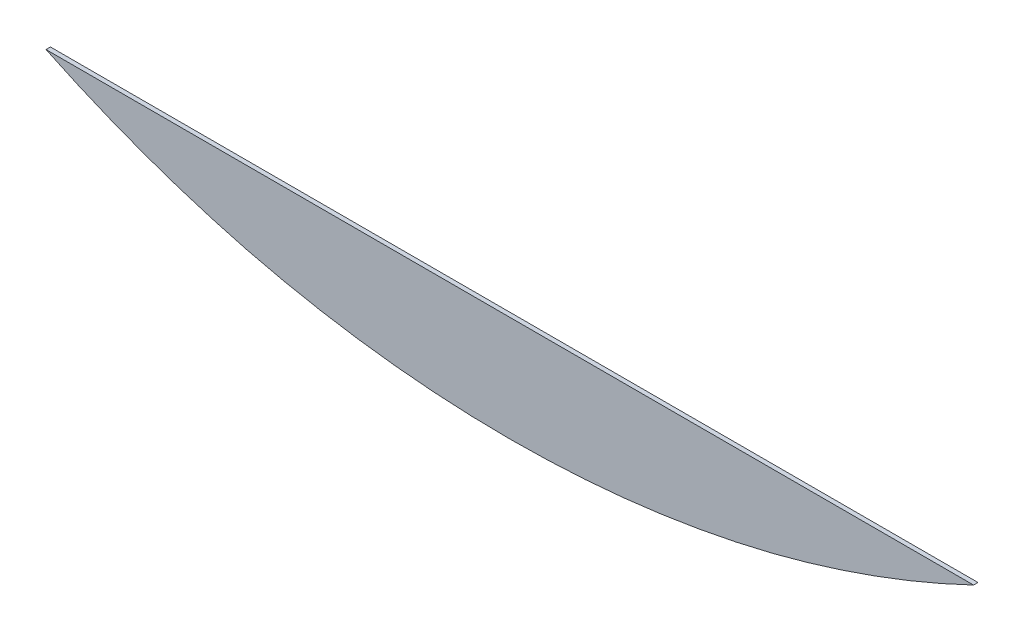
ISO-10303-21;
HEADER;
FILE_DESCRIPTION(('STEP AP214'),'2;1');
FILE_NAME('part.step','',(''),(''),'','','');
FILE_SCHEMA(('AUTOMOTIVE_DESIGN { 1 0 10303 214 1 1 1 1 }'));
ENDSEC;
DATA;
#1=APPLICATION_CONTEXT('core data for automotive mechanical design processes');
#2=APPLICATION_PROTOCOL_DEFINITION('international standard','automotive_design',2000,#1);
#3=PRODUCT_CONTEXT('',#1,'mechanical');
#4=PRODUCT('Part','Part','',(#3));
#5=PRODUCT_RELATED_PRODUCT_CATEGORY('part','',(#4));
#6=PRODUCT_DEFINITION_FORMATION('','',#4);
#7=PRODUCT_DEFINITION_CONTEXT('part definition',#1,'design');
#8=PRODUCT_DEFINITION('design','',#6,#7);
#9=PRODUCT_DEFINITION_SHAPE('','',#8);
#10=(LENGTH_UNIT() NAMED_UNIT(*) SI_UNIT(.MILLI.,.METRE.));
#11=(NAMED_UNIT(*) PLANE_ANGLE_UNIT() SI_UNIT($,.RADIAN.));
#12=(NAMED_UNIT(*) SI_UNIT($,.STERADIAN.) SOLID_ANGLE_UNIT());
#13=UNCERTAINTY_MEASURE_WITH_UNIT(LENGTH_MEASURE(1.E-05),#10,'distance_accuracy_value','');
#14=(GEOMETRIC_REPRESENTATION_CONTEXT(3) GLOBAL_UNCERTAINTY_ASSIGNED_CONTEXT((#13)) GLOBAL_UNIT_ASSIGNED_CONTEXT((#10,
#11,#12)) REPRESENTATION_CONTEXT('',''));
#15=CARTESIAN_POINT('',(0.,0.,0.));
#16=DIRECTION('',(0.,0.,1.));
#17=DIRECTION('',(1.,0.,0.));
#18=AXIS2_PLACEMENT_3D('',#15,#16,#17);
#19=CARTESIAN_POINT('',(338.952079060061,706.205902691886,3.2004));
#20=DIRECTION('',(0.,0.,-1.));
#21=DIRECTION('',(-1.,0.,0.));
#22=AXIS2_PLACEMENT_3D('',#19,#20,#21);
#23=CYLINDRICAL_SURFACE('',#22,783.336);
#24=CARTESIAN_POINT('',(338.952079060061,706.205902691886,0.));
#25=DIRECTION('',(0.,0.,1.));
#26=DIRECTION('',(1.,0.,0.));
#27=AXIS2_PLACEMENT_3D('',#24,#25,#26);
#28=CIRCLE('',#27,783.336);
#29=CARTESIAN_POINT('',(0.,0.,0.));
#30=VERTEX_POINT('',#29);
#31=CARTESIAN_POINT('',(144.78,-52.6830830033161,0.));
#32=VERTEX_POINT('',#31);
#33=EDGE_CURVE('E96',#30,#32,#28,.T.);
#34=ORIENTED_EDGE('',*,*,#33,.T.);
#35=DIRECTION('',(0.,0.,-1.));
#36=VECTOR('',#35,1.);
#37=CARTESIAN_POINT('',(144.78,-52.6830830033161,3.2004));
#38=LINE('',#37,#36);
#39=CARTESIAN_POINT('',(144.78,-52.6830830033161,3.2004));
#40=VERTEX_POINT('',#39);
#41=EDGE_CURVE('E11',#40,#32,#38,.T.);
#42=ORIENTED_EDGE('',*,*,#41,.F.);
#43=CARTESIAN_POINT('',(338.952079060061,706.205902691886,3.2004));
#44=DIRECTION('',(0.,0.,1.));
#45=DIRECTION('',(1.,0.,0.));
#46=AXIS2_PLACEMENT_3D('',#43,#44,#45);
#47=CIRCLE('',#46,783.336);
#48=CARTESIAN_POINT('',(0.,0.,3.2004));
#49=VERTEX_POINT('',#48);
#50=EDGE_CURVE('E84',#49,#40,#47,.T.);
#51=ORIENTED_EDGE('',*,*,#50,.F.);
#52=DIRECTION('',(0.,0.,-1.));
#53=VECTOR('',#52,1.);
#54=CARTESIAN_POINT('',(0.,0.,3.2004));
#55=LINE('',#54,#53);
#56=EDGE_CURVE('E92',#49,#30,#55,.T.);
#57=ORIENTED_EDGE('',*,*,#56,.T.);
#58=EDGE_LOOP('',(#34,#42,#51,#57));
#59=FACE_BOUND('',#58,.T.);
#60=ADVANCED_FACE('F33',(#59),#23,.T.);
#61=CARTESIAN_POINT('',(335.28,707.136,3.2004));
#62=DIRECTION('',(0.,0.,-1.));
#63=DIRECTION('',(-1.,0.,0.));
#64=AXIS2_PLACEMENT_3D('',#61,#62,#63);
#65=CYLINDRICAL_SURFACE('',#64,783.336);
#66=CARTESIAN_POINT('',(335.28,707.136,0.));
#67=DIRECTION('',(0.,0.,1.));
#68=DIRECTION('',(1.,0.,0.));
#69=AXIS2_PLACEMENT_3D('',#66,#67,#68);
#70=CIRCLE('',#69,783.336);
#71=CARTESIAN_POINT('',(525.78,-52.6830830033161,0.));
#72=VERTEX_POINT('',#71);
#73=EDGE_CURVE('E88',#32,#72,#70,.T.);
#74=ORIENTED_EDGE('',*,*,#73,.T.);
#75=DIRECTION('',(0.,0.,-1.));
#76=VECTOR('',#75,1.);
#77=CARTESIAN_POINT('',(525.78,-52.6830830033161,3.2004));
#78=LINE('',#77,#76);
#79=CARTESIAN_POINT('',(525.78,-52.6830830033161,3.2004));
#80=VERTEX_POINT('',#79);
#81=EDGE_CURVE('E41',#80,#72,#78,.T.);
#82=ORIENTED_EDGE('',*,*,#81,.F.);
#83=CARTESIAN_POINT('',(335.28,707.136,3.2004));
#84=DIRECTION('',(0.,0.,1.));
#85=DIRECTION('',(1.,0.,0.));
#86=AXIS2_PLACEMENT_3D('',#83,#84,#85);
#87=CIRCLE('',#86,783.336);
#88=EDGE_CURVE('E79',#40,#80,#87,.T.);
#89=ORIENTED_EDGE('',*,*,#88,.F.);
#90=ORIENTED_EDGE('',*,*,#41,.T.);
#91=EDGE_LOOP('',(#74,#82,#89,#90));
#92=FACE_BOUND('',#91,.T.);
#93=ADVANCED_FACE('F87',(#92),#65,.T.);
#94=CARTESIAN_POINT('',(331.607920939939,706.205902691887,3.2004));
#95=DIRECTION('',(0.,0.,-1.));
#96=DIRECTION('',(-1.,0.,0.));
#97=AXIS2_PLACEMENT_3D('',#94,#95,#96);
#98=CYLINDRICAL_SURFACE('',#97,783.336);
#99=CARTESIAN_POINT('',(331.607920939939,706.205902691887,0.));
#100=DIRECTION('',(0.,0.,1.));
#101=DIRECTION('',(-1.,0.,0.));
#102=AXIS2_PLACEMENT_3D('',#99,#100,#101);
#103=CIRCLE('',#102,783.336);
#104=CARTESIAN_POINT('',(670.56,0.,0.));
#105=VERTEX_POINT('',#104);
#106=EDGE_CURVE('E66',#72,#105,#103,.T.);
#107=ORIENTED_EDGE('',*,*,#106,.T.);
#108=DIRECTION('',(0.,0.,-1.));
#109=VECTOR('',#108,1.);
#110=CARTESIAN_POINT('',(670.56,0.,3.2004));
#111=LINE('',#110,#109);
#112=CARTESIAN_POINT('',(670.56,0.,3.2004));
#113=VERTEX_POINT('',#112);
#114=EDGE_CURVE('E89',#113,#105,#111,.T.);
#115=ORIENTED_EDGE('',*,*,#114,.F.);
#116=CARTESIAN_POINT('',(331.607920939939,706.205902691887,3.2004));
#117=DIRECTION('',(0.,0.,1.));
#118=DIRECTION('',(-1.,0.,0.));
#119=AXIS2_PLACEMENT_3D('',#116,#117,#118);
#120=CIRCLE('',#119,783.336);
#121=EDGE_CURVE('E82',#80,#113,#120,.T.);
#122=ORIENTED_EDGE('',*,*,#121,.F.);
#123=ORIENTED_EDGE('',*,*,#81,.T.);
#124=EDGE_LOOP('',(#107,#115,#122,#123));
#125=FACE_BOUND('',#124,.T.);
#126=ADVANCED_FACE('F90',(#125),#98,.T.);
#127=CARTESIAN_POINT('',(0.,0.,3.2004));
#128=DIRECTION('',(0.,-1.,0.));
#129=DIRECTION('',(1.,0.,0.));
#130=AXIS2_PLACEMENT_3D('',#127,#128,#129);
#131=PLANE('',#130);
#132=DIRECTION('',(-1.,0.,0.));
#133=VECTOR('',#132,1.);
#134=CARTESIAN_POINT('',(0.,0.,0.));
#135=LINE('',#134,#133);
#136=EDGE_CURVE('E72',#105,#30,#135,.T.);
#137=ORIENTED_EDGE('',*,*,#136,.T.);
#138=ORIENTED_EDGE('',*,*,#56,.F.);
#139=DIRECTION('',(-1.,0.,0.));
#140=VECTOR('',#139,1.);
#141=CARTESIAN_POINT('',(0.,0.,3.2004));
#142=LINE('',#141,#140);
#143=EDGE_CURVE('E49',#113,#49,#142,.T.);
#144=ORIENTED_EDGE('',*,*,#143,.F.);
#145=ORIENTED_EDGE('',*,*,#114,.T.);
#146=EDGE_LOOP('',(#137,#138,#144,#145));
#147=FACE_BOUND('',#146,.T.);
#148=ADVANCED_FACE('F103',(#147),#131,.F.);
#149=CARTESIAN_POINT('',(338.952079060061,706.205902691886,3.2004));
#150=DIRECTION('',(0.,0.,1.));
#151=DIRECTION('',(1.,0.,0.));
#152=AXIS2_PLACEMENT_3D('',#149,#150,#151);
#153=PLANE('',#152);
#154=ORIENTED_EDGE('',*,*,#50,.T.);
#155=ORIENTED_EDGE('',*,*,#88,.T.);
#156=ORIENTED_EDGE('',*,*,#121,.T.);
#157=ORIENTED_EDGE('',*,*,#143,.T.);
#158=EDGE_LOOP('',(#154,#155,#156,#157));
#159=FACE_BOUND('',#158,.T.);
#160=ADVANCED_FACE('F80',(#159),#153,.T.);
#161=CARTESIAN_POINT('',(338.952079060061,706.205902691886,0.));
#162=DIRECTION('',(0.,0.,1.));
#163=DIRECTION('',(1.,0.,0.));
#164=AXIS2_PLACEMENT_3D('',#161,#162,#163);
#165=PLANE('',#164);
#166=ORIENTED_EDGE('',*,*,#33,.F.);
#167=ORIENTED_EDGE('',*,*,#136,.F.);
#168=ORIENTED_EDGE('',*,*,#106,.F.);
#169=ORIENTED_EDGE('',*,*,#73,.F.);
#170=EDGE_LOOP('',(#166,#167,#168,#169));
#171=FACE_BOUND('',#170,.T.);
#172=ADVANCED_FACE('F106',(#171),#165,.F.);
#173=CLOSED_SHELL('',(#60,#93,#126,#148,#160,#172));
#174=MANIFOLD_SOLID_BREP('B2',#173);
#175=ADVANCED_BREP_SHAPE_REPRESENTATION('',(#18,#174),#14);
#176=SHAPE_DEFINITION_REPRESENTATION(#9,#175);
ENDSEC;
END-ISO-10303-21;
